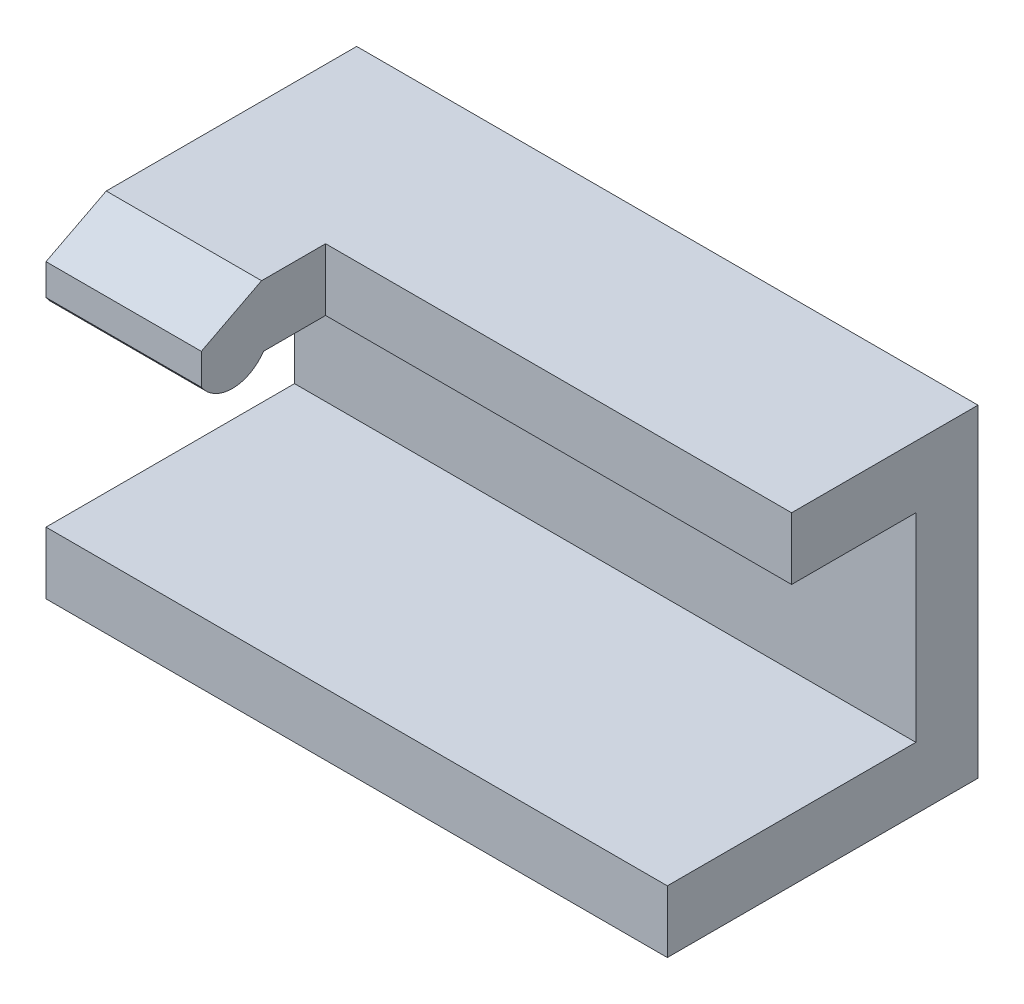
ISO-10303-21;
HEADER;
FILE_DESCRIPTION(('STEP AP214'),'2;1');
FILE_NAME('part.step','',(''),(''),'','','');
FILE_SCHEMA(('AUTOMOTIVE_DESIGN { 1 0 10303 214 1 1 1 1 }'));
ENDSEC;
DATA;
#1=APPLICATION_CONTEXT('core data for automotive mechanical design processes');
#2=APPLICATION_PROTOCOL_DEFINITION('international standard','automotive_design',2000,#1);
#3=PRODUCT_CONTEXT('',#1,'mechanical');
#4=PRODUCT('Part','Part','',(#3));
#5=PRODUCT_RELATED_PRODUCT_CATEGORY('part','',(#4));
#6=PRODUCT_DEFINITION_FORMATION('','',#4);
#7=PRODUCT_DEFINITION_CONTEXT('part definition',#1,'design');
#8=PRODUCT_DEFINITION('design','',#6,#7);
#9=PRODUCT_DEFINITION_SHAPE('','',#8);
#10=(LENGTH_UNIT() NAMED_UNIT(*) SI_UNIT(.MILLI.,.METRE.));
#11=(NAMED_UNIT(*) PLANE_ANGLE_UNIT() SI_UNIT($,.RADIAN.));
#12=(NAMED_UNIT(*) SI_UNIT($,.STERADIAN.) SOLID_ANGLE_UNIT());
#13=UNCERTAINTY_MEASURE_WITH_UNIT(LENGTH_MEASURE(1.E-05),#10,'distance_accuracy_value','');
#14=(GEOMETRIC_REPRESENTATION_CONTEXT(3) GLOBAL_UNCERTAINTY_ASSIGNED_CONTEXT((#13)) GLOBAL_UNIT_ASSIGNED_CONTEXT((#10,
#11,#12)) REPRESENTATION_CONTEXT('',''));
#15=CARTESIAN_POINT('',(0.,0.,0.));
#16=DIRECTION('',(0.,0.,1.));
#17=DIRECTION('',(1.,0.,0.));
#18=AXIS2_PLACEMENT_3D('',#15,#16,#17);
#19=CARTESIAN_POINT('',(0.,4.064,12.7));
#20=DIRECTION('',(-1.,0.,0.));
#21=DIRECTION('',(0.,-1.,0.));
#22=AXIS2_PLACEMENT_3D('',#19,#20,#21);
#23=PLANE('',#22);
#24=DIRECTION('',(0.,1.,0.));
#25=VECTOR('',#24,1.);
#26=CARTESIAN_POINT('',(0.,4.064,7.62));
#27=LINE('',#26,#25);
#28=CARTESIAN_POINT('',(0.,4.064,7.62));
#29=VERTEX_POINT('',#28);
#30=CARTESIAN_POINT('',(0.,6.604,7.62));
#31=VERTEX_POINT('',#30);
#32=EDGE_CURVE('E139',#29,#31,#27,.T.);
#33=ORIENTED_EDGE('',*,*,#32,.T.);
#34=DIRECTION('',(0.,0.,1.));
#35=VECTOR('',#34,1.);
#36=CARTESIAN_POINT('',(0.,6.604,10.2377193860486));
#37=LINE('',#36,#35);
#38=CARTESIAN_POINT('',(0.,6.604,10.2377193860486));
#39=VERTEX_POINT('',#38);
#40=EDGE_CURVE('E191',#31,#39,#37,.T.);
#41=ORIENTED_EDGE('',*,*,#40,.T.);
#42=DIRECTION('',(0.,-0.458399351245607,0.888746327574751));
#43=VECTOR('',#42,1.);
#44=CARTESIAN_POINT('',(0.,5.334,12.7));
#45=LINE('',#44,#43);
#46=CARTESIAN_POINT('',(0.,5.334,12.7));
#47=VERTEX_POINT('',#46);
#48=EDGE_CURVE('E197',#39,#47,#45,.T.);
#49=ORIENTED_EDGE('',*,*,#48,.T.);
#50=DIRECTION('',(0.,1.,0.));
#51=VECTOR('',#50,1.);
#52=CARTESIAN_POINT('',(0.,4.064,12.7));
#53=LINE('',#52,#51);
#54=CARTESIAN_POINT('',(0.,4.064,12.7));
#55=VERTEX_POINT('',#54);
#56=EDGE_CURVE('E146',#55,#47,#53,.T.);
#57=ORIENTED_EDGE('',*,*,#56,.F.);
#58=CARTESIAN_POINT('',(0.,4.90642269675027,11.43));
#59=DIRECTION('',(-1.,0.,0.));
#60=DIRECTION('',(0.,-1.,0.));
#61=AXIS2_PLACEMENT_3D('',#58,#59,#60);
#62=CIRCLE('',#61,1.524);
#63=CARTESIAN_POINT('',(0.,4.064,10.16));
#64=VERTEX_POINT('',#63);
#65=EDGE_CURVE('E76',#55,#64,#62,.F.);
#66=ORIENTED_EDGE('',*,*,#65,.T.);
#67=DIRECTION('',(0.,0.,-1.));
#68=VECTOR('',#67,1.);
#69=CARTESIAN_POINT('',(0.,4.064,12.7));
#70=LINE('',#69,#68);
#71=EDGE_CURVE('E61',#64,#29,#70,.T.);
#72=ORIENTED_EDGE('',*,*,#71,.T.);
#73=EDGE_LOOP('',(#33,#41,#49,#57,#66,#72));
#74=FACE_BOUND('',#73,.T.);
#75=ADVANCED_FACE('F38',(#74),#23,.F.);
#76=CARTESIAN_POINT('',(0.,0.,2.54));
#77=DIRECTION('',(0.,0.,1.));
#78=DIRECTION('',(1.,0.,0.));
#79=AXIS2_PLACEMENT_3D('',#76,#77,#78);
#80=PLANE('',#79);
#81=DIRECTION('',(0.,1.,0.));
#82=VECTOR('',#81,1.);
#83=CARTESIAN_POINT('',(0.,0.,2.54));
#84=LINE('',#83,#82);
#85=CARTESIAN_POINT('',(0.,2.794,2.54));
#86=VERTEX_POINT('',#85);
#87=CARTESIAN_POINT('',(0.,4.064,2.54));
#88=VERTEX_POINT('',#87);
#89=EDGE_CURVE('E52',#86,#88,#84,.T.);
#90=ORIENTED_EDGE('',*,*,#89,.F.);
#91=DIRECTION('',(-1.,0.,0.));
#92=VECTOR('',#91,1.);
#93=CARTESIAN_POINT('',(0.,2.794,2.54));
#94=LINE('',#93,#92);
#95=CARTESIAN_POINT('',(-6.35,2.794,2.54));
#96=VERTEX_POINT('',#95);
#97=EDGE_CURVE('E213',#86,#96,#94,.T.);
#98=ORIENTED_EDGE('',*,*,#97,.T.);
#99=DIRECTION('',(0.,-1.,0.));
#100=VECTOR('',#99,1.);
#101=CARTESIAN_POINT('',(-6.35,0.,2.54));
#102=LINE('',#101,#100);
#103=CARTESIAN_POINT('',(-6.35,-4.064,2.54));
#104=VERTEX_POINT('',#103);
#105=EDGE_CURVE('E124',#96,#104,#102,.T.);
#106=ORIENTED_EDGE('',*,*,#105,.T.);
#107=DIRECTION('',(1.,0.,0.));
#108=VECTOR('',#107,1.);
#109=CARTESIAN_POINT('',(0.,-4.064,2.54));
#110=LINE('',#109,#108);
#111=CARTESIAN_POINT('',(19.05,-4.064,2.54));
#112=VERTEX_POINT('',#111);
#113=EDGE_CURVE('E122',#104,#112,#110,.T.);
#114=ORIENTED_EDGE('',*,*,#113,.T.);
#115=DIRECTION('',(0.,-1.,0.));
#116=VECTOR('',#115,1.);
#117=CARTESIAN_POINT('',(19.05,0.,2.54));
#118=LINE('',#117,#116);
#119=CARTESIAN_POINT('',(19.05,4.064,2.54));
#120=VERTEX_POINT('',#119);
#121=EDGE_CURVE('E119',#120,#112,#118,.T.);
#122=ORIENTED_EDGE('',*,*,#121,.F.);
#123=DIRECTION('',(1.,0.,0.));
#124=VECTOR('',#123,1.);
#125=CARTESIAN_POINT('',(0.,4.064,2.54));
#126=LINE('',#125,#124);
#127=EDGE_CURVE('E103',#88,#120,#126,.T.);
#128=ORIENTED_EDGE('',*,*,#127,.F.);
#129=EDGE_LOOP('',(#90,#98,#106,#114,#122,#128));
#130=FACE_BOUND('',#129,.T.);
#131=ADVANCED_FACE('F120',(#130),#80,.T.);
#132=CARTESIAN_POINT('',(0.,0.,0.));
#133=DIRECTION('',(0.,0.,1.));
#134=DIRECTION('',(1.,0.,0.));
#135=AXIS2_PLACEMENT_3D('',#132,#133,#134);
#136=PLANE('',#135);
#137=DIRECTION('',(1.,0.,0.));
#138=VECTOR('',#137,1.);
#139=CARTESIAN_POINT('',(-19.8523126484497,6.60400000000001,0.));
#140=LINE('',#139,#138);
#141=CARTESIAN_POINT('',(-6.35,6.60400000000001,0.));
#142=VERTEX_POINT('',#141);
#143=CARTESIAN_POINT('',(19.05,6.60399999999999,0.));
#144=VERTEX_POINT('',#143);
#145=EDGE_CURVE('E187',#142,#144,#140,.T.);
#146=ORIENTED_EDGE('',*,*,#145,.T.);
#147=DIRECTION('',(0.,-1.,0.));
#148=VECTOR('',#147,1.);
#149=CARTESIAN_POINT('',(19.05,0.,0.));
#150=LINE('',#149,#148);
#151=CARTESIAN_POINT('',(19.05,-6.604,0.));
#152=VERTEX_POINT('',#151);
#153=EDGE_CURVE('E134',#144,#152,#150,.T.);
#154=ORIENTED_EDGE('',*,*,#153,.T.);
#155=DIRECTION('',(1.,0.,0.));
#156=VECTOR('',#155,1.);
#157=CARTESIAN_POINT('',(-19.113342038932,-6.60400000000005,0.));
#158=LINE('',#157,#156);
#159=CARTESIAN_POINT('',(-6.35,-6.60400000000004,0.));
#160=VERTEX_POINT('',#159);
#161=EDGE_CURVE('E224',#160,#152,#158,.T.);
#162=ORIENTED_EDGE('',*,*,#161,.F.);
#163=DIRECTION('',(0.,-1.,0.));
#164=VECTOR('',#163,1.);
#165=CARTESIAN_POINT('',(-6.35,0.,0.));
#166=LINE('',#165,#164);
#167=CARTESIAN_POINT('',(-6.35,2.794,0.));
#168=VERTEX_POINT('',#167);
#169=EDGE_CURVE('E159',#168,#160,#166,.T.);
#170=ORIENTED_EDGE('',*,*,#169,.F.);
#171=DIRECTION('',(-1.,0.,0.));
#172=VECTOR('',#171,1.);
#173=CARTESIAN_POINT('',(0.,2.794,0.));
#174=LINE('',#173,#172);
#175=CARTESIAN_POINT('',(0.,2.794,0.));
#176=VERTEX_POINT('',#175);
#177=EDGE_CURVE('E200',#176,#168,#174,.T.);
#178=ORIENTED_EDGE('',*,*,#177,.F.);
#179=DIRECTION('',(0.,1.,0.));
#180=VECTOR('',#179,1.);
#181=CARTESIAN_POINT('',(0.,0.,0.));
#182=LINE('',#181,#180);
#183=CARTESIAN_POINT('',(0.,4.064,0.));
#184=VERTEX_POINT('',#183);
#185=EDGE_CURVE('E13',#176,#184,#182,.T.);
#186=ORIENTED_EDGE('',*,*,#185,.T.);
#187=DIRECTION('',(-1.,0.,0.));
#188=VECTOR('',#187,1.);
#189=CARTESIAN_POINT('',(0.,4.064,0.));
#190=LINE('',#189,#188);
#191=CARTESIAN_POINT('',(-6.35,4.064,0.));
#192=VERTEX_POINT('',#191);
#193=EDGE_CURVE('E206',#184,#192,#190,.T.);
#194=ORIENTED_EDGE('',*,*,#193,.T.);
#195=EDGE_CURVE('E125',#142,#192,#166,.T.);
#196=ORIENTED_EDGE('',*,*,#195,.F.);
#197=EDGE_LOOP('',(#146,#154,#162,#170,#178,#186,#194,#196));
#198=FACE_BOUND('',#197,.T.);
#199=ADVANCED_FACE('F289',(#198),#136,.F.);
#200=CARTESIAN_POINT('',(-6.35,0.,2.54));
#201=DIRECTION('',(1.,0.,0.));
#202=DIRECTION('',(0.,0.,-1.));
#203=AXIS2_PLACEMENT_3D('',#200,#201,#202);
#204=PLANE('',#203);
#205=DIRECTION('',(0.,0.,1.));
#206=VECTOR('',#205,1.);
#207=CARTESIAN_POINT('',(-6.35,2.794,2.54));
#208=LINE('',#207,#206);
#209=EDGE_CURVE('E45',#168,#96,#208,.T.);
#210=ORIENTED_EDGE('',*,*,#209,.F.);
#211=ORIENTED_EDGE('',*,*,#169,.T.);
#212=DIRECTION('',(0.,0.,1.));
#213=VECTOR('',#212,1.);
#214=CARTESIAN_POINT('',(-6.35,-6.60400000000004,12.700000000109));
#215=LINE('',#214,#213);
#216=CARTESIAN_POINT('',(-6.35,-6.60400000000004,12.700000000109));
#217=VERTEX_POINT('',#216);
#218=EDGE_CURVE('E220',#160,#217,#215,.T.);
#219=ORIENTED_EDGE('',*,*,#218,.T.);
#220=DIRECTION('',(0.,1.,0.));
#221=VECTOR('',#220,1.);
#222=CARTESIAN_POINT('',(-6.35,0.,12.6999999999953));
#223=LINE('',#222,#221);
#224=CARTESIAN_POINT('',(-6.35,-4.064,12.700000000109));
#225=VERTEX_POINT('',#224);
#226=EDGE_CURVE('E166',#217,#225,#223,.T.);
#227=ORIENTED_EDGE('',*,*,#226,.T.);
#228=DIRECTION('',(0.,0.,-1.));
#229=VECTOR('',#228,1.);
#230=CARTESIAN_POINT('',(-6.35,-4.064,7.62));
#231=LINE('',#230,#229);
#232=EDGE_CURVE('E115',#225,#104,#231,.T.);
#233=ORIENTED_EDGE('',*,*,#232,.T.);
#234=ORIENTED_EDGE('',*,*,#105,.F.);
#235=EDGE_LOOP('',(#210,#211,#219,#227,#233,#234));
#236=FACE_BOUND('',#235,.T.);
#237=ADVANCED_FACE('F300',(#236),#204,.F.);
#238=CARTESIAN_POINT('',(0.,0.,7.62));
#239=DIRECTION('',(0.,0.,1.));
#240=DIRECTION('',(1.,0.,0.));
#241=AXIS2_PLACEMENT_3D('',#238,#239,#240);
#242=PLANE('',#241);
#243=DIRECTION('',(0.,1.,0.));
#244=VECTOR('',#243,1.);
#245=CARTESIAN_POINT('',(19.05,0.,7.62));
#246=LINE('',#245,#244);
#247=CARTESIAN_POINT('',(19.05,4.064,7.62));
#248=VERTEX_POINT('',#247);
#249=CARTESIAN_POINT('',(19.05,6.60399999999999,7.62));
#250=VERTEX_POINT('',#249);
#251=EDGE_CURVE('E131',#248,#250,#246,.T.);
#252=ORIENTED_EDGE('',*,*,#251,.T.);
#253=DIRECTION('',(-1.,0.,0.));
#254=VECTOR('',#253,1.);
#255=CARTESIAN_POINT('',(26.7751084134787,6.60399999999999,7.62));
#256=LINE('',#255,#254);
#257=EDGE_CURVE('E217',#250,#31,#256,.T.);
#258=ORIENTED_EDGE('',*,*,#257,.T.);
#259=ORIENTED_EDGE('',*,*,#32,.F.);
#260=DIRECTION('',(1.,0.,0.));
#261=VECTOR('',#260,1.);
#262=CARTESIAN_POINT('',(0.,4.064,7.62));
#263=LINE('',#262,#261);
#264=EDGE_CURVE('E114',#29,#248,#263,.T.);
#265=ORIENTED_EDGE('',*,*,#264,.T.);
#266=EDGE_LOOP('',(#252,#258,#259,#265));
#267=FACE_BOUND('',#266,.T.);
#268=ADVANCED_FACE('F325',(#267),#242,.T.);
#269=CARTESIAN_POINT('',(19.05,0.,2.54));
#270=DIRECTION('',(1.,0.,0.));
#271=DIRECTION('',(0.,1.,0.));
#272=AXIS2_PLACEMENT_3D('',#269,#270,#271);
#273=PLANE('',#272);
#274=ORIENTED_EDGE('',*,*,#153,.F.);
#275=DIRECTION('',(0.,0.,1.));
#276=VECTOR('',#275,1.);
#277=CARTESIAN_POINT('',(19.05,6.60399999999999,7.62));
#278=LINE('',#277,#276);
#279=EDGE_CURVE('E216',#144,#250,#278,.T.);
#280=ORIENTED_EDGE('',*,*,#279,.T.);
#281=ORIENTED_EDGE('',*,*,#251,.F.);
#282=DIRECTION('',(0.,0.,-1.));
#283=VECTOR('',#282,1.);
#284=CARTESIAN_POINT('',(19.05,4.064,7.62));
#285=LINE('',#284,#283);
#286=EDGE_CURVE('E109',#248,#120,#285,.T.);
#287=ORIENTED_EDGE('',*,*,#286,.T.);
#288=ORIENTED_EDGE('',*,*,#121,.T.);
#289=DIRECTION('',(0.,0.,-1.));
#290=VECTOR('',#289,1.);
#291=CARTESIAN_POINT('',(19.05,-4.064,7.62));
#292=LINE('',#291,#290);
#293=CARTESIAN_POINT('',(19.05,-4.064,12.700000000109));
#294=VERTEX_POINT('',#293);
#295=EDGE_CURVE('E167',#294,#112,#292,.T.);
#296=ORIENTED_EDGE('',*,*,#295,.F.);
#297=DIRECTION('',(0.,-1.,0.));
#298=VECTOR('',#297,1.);
#299=CARTESIAN_POINT('',(19.05,0.,12.6999999999953));
#300=LINE('',#299,#298);
#301=CARTESIAN_POINT('',(19.05,-6.604,12.700000000109));
#302=VERTEX_POINT('',#301);
#303=EDGE_CURVE('E164',#294,#302,#300,.T.);
#304=ORIENTED_EDGE('',*,*,#303,.T.);
#305=DIRECTION('',(0.,0.,-1.));
#306=VECTOR('',#305,1.);
#307=CARTESIAN_POINT('',(19.05,-6.604,12.700000000109));
#308=LINE('',#307,#306);
#309=EDGE_CURVE('E228',#302,#152,#308,.T.);
#310=ORIENTED_EDGE('',*,*,#309,.T.);
#311=EDGE_LOOP('',(#274,#280,#281,#287,#288,#296,#304,#310));
#312=FACE_BOUND('',#311,.T.);
#313=ADVANCED_FACE('F128',(#312),#273,.T.);
#314=ORIENTED_EDGE('',*,*,#195,.T.);
#315=DIRECTION('',(0.,0.,-1.));
#316=VECTOR('',#315,1.);
#317=CARTESIAN_POINT('',(-6.35,4.064,7.62));
#318=LINE('',#317,#316);
#319=CARTESIAN_POINT('',(-6.35,4.064,10.16));
#320=VERTEX_POINT('',#319);
#321=EDGE_CURVE('E132',#320,#192,#318,.T.);
#322=ORIENTED_EDGE('',*,*,#321,.F.);
#323=CARTESIAN_POINT('',(-6.35,4.90642269675027,11.43));
#324=DIRECTION('',(-1.,0.,0.));
#325=DIRECTION('',(0.,0.,-1.));
#326=AXIS2_PLACEMENT_3D('',#323,#324,#325);
#327=CIRCLE('',#326,1.524);
#328=CARTESIAN_POINT('',(-6.35,4.064,12.7));
#329=VERTEX_POINT('',#328);
#330=EDGE_CURVE('E179',#320,#329,#327,.T.);
#331=ORIENTED_EDGE('',*,*,#330,.T.);
#332=DIRECTION('',(0.,-1.,0.));
#333=VECTOR('',#332,1.);
#334=CARTESIAN_POINT('',(-6.35,4.064,12.7));
#335=LINE('',#334,#333);
#336=CARTESIAN_POINT('',(-6.35,5.334,12.7));
#337=VERTEX_POINT('',#336);
#338=EDGE_CURVE('E141',#337,#329,#335,.T.);
#339=ORIENTED_EDGE('',*,*,#338,.F.);
#340=DIRECTION('',(0.,0.458399351245606,-0.888746327574751));
#341=VECTOR('',#340,1.);
#342=CARTESIAN_POINT('',(-6.35,5.334,12.7));
#343=LINE('',#342,#341);
#344=CARTESIAN_POINT('',(-6.35,6.604,10.2377193860486));
#345=VERTEX_POINT('',#344);
#346=EDGE_CURVE('E85',#337,#345,#343,.T.);
#347=ORIENTED_EDGE('',*,*,#346,.T.);
#348=DIRECTION('',(0.,0.,-1.));
#349=VECTOR('',#348,1.);
#350=CARTESIAN_POINT('',(-6.35,6.604,10.2377193860486));
#351=LINE('',#350,#349);
#352=EDGE_CURVE('E194',#345,#142,#351,.T.);
#353=ORIENTED_EDGE('',*,*,#352,.T.);
#354=EDGE_LOOP('',(#314,#322,#331,#339,#347,#353));
#355=FACE_BOUND('',#354,.T.);
#356=ADVANCED_FACE('F285',(#355),#204,.F.);
#357=CARTESIAN_POINT('',(0.,4.064,7.62));
#358=DIRECTION('',(0.,1.,0.));
#359=DIRECTION('',(0.,0.,1.));
#360=AXIS2_PLACEMENT_3D('',#357,#358,#359);
#361=PLANE('',#360);
#362=ORIENTED_EDGE('',*,*,#321,.T.);
#363=ORIENTED_EDGE('',*,*,#193,.F.);
#364=DIRECTION('',(0.,0.,1.));
#365=VECTOR('',#364,1.);
#366=CARTESIAN_POINT('',(0.,4.064,-3.556));
#367=LINE('',#366,#365);
#368=EDGE_CURVE('E112',#184,#88,#367,.T.);
#369=ORIENTED_EDGE('',*,*,#368,.T.);
#370=ORIENTED_EDGE('',*,*,#127,.T.);
#371=ORIENTED_EDGE('',*,*,#286,.F.);
#372=ORIENTED_EDGE('',*,*,#264,.F.);
#373=ORIENTED_EDGE('',*,*,#71,.F.);
#374=DIRECTION('',(-1.,0.,0.));
#375=VECTOR('',#374,1.);
#376=CARTESIAN_POINT('',(0.0898569581452811,4.064,10.16));
#377=LINE('',#376,#375);
#378=EDGE_CURVE('E145',#64,#320,#377,.T.);
#379=ORIENTED_EDGE('',*,*,#378,.T.);
#380=EDGE_LOOP('',(#362,#363,#369,#370,#371,#372,#373,#379));
#381=FACE_BOUND('',#380,.T.);
#382=ADVANCED_FACE('F106',(#381),#361,.F.);
#383=CARTESIAN_POINT('',(0.,-4.064,7.62));
#384=DIRECTION('',(0.,1.,0.));
#385=DIRECTION('',(0.,0.,1.));
#386=AXIS2_PLACEMENT_3D('',#383,#384,#385);
#387=PLANE('',#386);
#388=ORIENTED_EDGE('',*,*,#113,.F.);
#389=ORIENTED_EDGE('',*,*,#232,.F.);
#390=DIRECTION('',(-1.,0.,0.));
#391=VECTOR('',#390,1.);
#392=CARTESIAN_POINT('',(0.,-4.064,12.6999999999953));
#393=LINE('',#392,#391);
#394=EDGE_CURVE('E182',#294,#225,#393,.T.);
#395=ORIENTED_EDGE('',*,*,#394,.F.);
#396=ORIENTED_EDGE('',*,*,#295,.T.);
#397=EDGE_LOOP('',(#388,#389,#395,#396));
#398=FACE_BOUND('',#397,.T.);
#399=ADVANCED_FACE('F302',(#398),#387,.T.);
#400=CARTESIAN_POINT('',(0.,0.,12.7));
#401=DIRECTION('',(0.,0.,-1.));
#402=DIRECTION('',(-1.,0.,0.));
#403=AXIS2_PLACEMENT_3D('',#400,#401,#402);
#404=PLANE('',#403);
#405=ORIENTED_EDGE('',*,*,#338,.T.);
#406=DIRECTION('',(1.,0.,0.));
#407=VECTOR('',#406,1.);
#408=CARTESIAN_POINT('',(-6.35,4.064,12.7));
#409=LINE('',#408,#407);
#410=EDGE_CURVE('E148',#329,#55,#409,.T.);
#411=ORIENTED_EDGE('',*,*,#410,.T.);
#412=ORIENTED_EDGE('',*,*,#56,.T.);
#413=DIRECTION('',(-1.,0.,0.));
#414=VECTOR('',#413,1.);
#415=CARTESIAN_POINT('',(-6.35,5.334,12.7));
#416=LINE('',#415,#414);
#417=EDGE_CURVE('E143',#47,#337,#416,.T.);
#418=ORIENTED_EDGE('',*,*,#417,.T.);
#419=EDGE_LOOP('',(#405,#411,#412,#418));
#420=FACE_BOUND('',#419,.T.);
#421=ADVANCED_FACE('F304',(#420),#404,.F.);
#422=CARTESIAN_POINT('',(0.0898569581452811,4.90642269675027,11.43));
#423=DIRECTION('',(-1.,0.,0.));
#424=DIRECTION('',(0.,0.,1.));
#425=AXIS2_PLACEMENT_3D('',#422,#423,#424);
#426=CYLINDRICAL_SURFACE('',#425,1.524);
#427=ORIENTED_EDGE('',*,*,#65,.F.);
#428=ORIENTED_EDGE('',*,*,#410,.F.);
#429=ORIENTED_EDGE('',*,*,#330,.F.);
#430=ORIENTED_EDGE('',*,*,#378,.F.);
#431=EDGE_LOOP('',(#427,#428,#429,#430));
#432=FACE_BOUND('',#431,.T.);
#433=ADVANCED_FACE('F281',(#432),#426,.T.);
#434=CARTESIAN_POINT('',(0.,0.,12.7));
#435=DIRECTION('',(0.,0.,-1.));
#436=DIRECTION('',(-1.,0.,0.));
#437=AXIS2_PLACEMENT_3D('',#434,#435,#436);
#438=PLANE('',#437);
#439=ORIENTED_EDGE('',*,*,#394,.T.);
#440=ORIENTED_EDGE('',*,*,#226,.F.);
#441=DIRECTION('',(1.,0.,0.));
#442=VECTOR('',#441,1.);
#443=CARTESIAN_POINT('',(-19.113342038932,-6.60400000000005,12.700000000109));
#444=LINE('',#443,#442);
#445=EDGE_CURVE('E225',#217,#302,#444,.T.);
#446=ORIENTED_EDGE('',*,*,#445,.T.);
#447=ORIENTED_EDGE('',*,*,#303,.F.);
#448=EDGE_LOOP('',(#439,#440,#446,#447));
#449=FACE_BOUND('',#448,.T.);
#450=ADVANCED_FACE('F409',(#449),#438,.F.);
#451=CARTESIAN_POINT('',(-19.8523126484497,5.33400000000001,12.7));
#452=DIRECTION('',(0.,0.888746327574751,0.458399351245606));
#453=DIRECTION('',(0.,-0.458399351245606,0.888746327574751));
#454=AXIS2_PLACEMENT_3D('',#451,#452,#453);
#455=PLANE('',#454);
#456=ORIENTED_EDGE('',*,*,#346,.F.);
#457=ORIENTED_EDGE('',*,*,#417,.F.);
#458=ORIENTED_EDGE('',*,*,#48,.F.);
#459=DIRECTION('',(1.,0.,0.));
#460=VECTOR('',#459,1.);
#461=CARTESIAN_POINT('',(-19.8523126484497,6.60400000000001,10.2377193860486));
#462=LINE('',#461,#460);
#463=EDGE_CURVE('E190',#345,#39,#462,.T.);
#464=ORIENTED_EDGE('',*,*,#463,.F.);
#465=EDGE_LOOP('',(#456,#457,#458,#464));
#466=FACE_BOUND('',#465,.T.);
#467=ADVANCED_FACE('F384',(#466),#455,.T.);
#468=CARTESIAN_POINT('',(-19.8523126484497,6.60400000000001,10.2377193860486));
#469=DIRECTION('',(0.,1.,0.));
#470=DIRECTION('',(-1.,0.,0.));
#471=AXIS2_PLACEMENT_3D('',#468,#469,#470);
#472=PLANE('',#471);
#473=ORIENTED_EDGE('',*,*,#352,.F.);
#474=ORIENTED_EDGE('',*,*,#463,.T.);
#475=ORIENTED_EDGE('',*,*,#40,.F.);
#476=ORIENTED_EDGE('',*,*,#257,.F.);
#477=ORIENTED_EDGE('',*,*,#279,.F.);
#478=ORIENTED_EDGE('',*,*,#145,.F.);
#479=EDGE_LOOP('',(#473,#474,#475,#476,#477,#478));
#480=FACE_BOUND('',#479,.T.);
#481=ADVANCED_FACE('F323',(#480),#472,.T.);
#482=CARTESIAN_POINT('',(0.,0.,-3.556));
#483=DIRECTION('',(1.,0.,0.));
#484=DIRECTION('',(0.,1.,0.));
#485=AXIS2_PLACEMENT_3D('',#482,#483,#484);
#486=PLANE('',#485);
#487=DIRECTION('',(0.,0.,1.));
#488=VECTOR('',#487,1.);
#489=CARTESIAN_POINT('',(0.,2.794,-3.556));
#490=LINE('',#489,#488);
#491=EDGE_CURVE('E209',#176,#86,#490,.T.);
#492=ORIENTED_EDGE('',*,*,#491,.T.);
#493=ORIENTED_EDGE('',*,*,#89,.T.);
#494=ORIENTED_EDGE('',*,*,#368,.F.);
#495=ORIENTED_EDGE('',*,*,#185,.F.);
#496=EDGE_LOOP('',(#492,#493,#494,#495));
#497=FACE_BOUND('',#496,.T.);
#498=ADVANCED_FACE('F292',(#497),#486,.F.);
#499=CARTESIAN_POINT('',(0.,2.794,-3.556));
#500=DIRECTION('',(0.,1.,0.));
#501=DIRECTION('',(0.,0.,1.));
#502=AXIS2_PLACEMENT_3D('',#499,#500,#501);
#503=PLANE('',#502);
#504=ORIENTED_EDGE('',*,*,#177,.T.);
#505=ORIENTED_EDGE('',*,*,#209,.T.);
#506=ORIENTED_EDGE('',*,*,#97,.F.);
#507=ORIENTED_EDGE('',*,*,#491,.F.);
#508=EDGE_LOOP('',(#504,#505,#506,#507));
#509=FACE_BOUND('',#508,.T.);
#510=ADVANCED_FACE('F296',(#509),#503,.T.);
#511=CARTESIAN_POINT('',(-19.113342038932,-6.60400000000005,12.700000000109));
#512=DIRECTION('',(0.,-1.,0.));
#513=DIRECTION('',(1.,0.,0.));
#514=AXIS2_PLACEMENT_3D('',#511,#512,#513);
#515=PLANE('',#514);
#516=ORIENTED_EDGE('',*,*,#218,.F.);
#517=ORIENTED_EDGE('',*,*,#161,.T.);
#518=ORIENTED_EDGE('',*,*,#309,.F.);
#519=ORIENTED_EDGE('',*,*,#445,.F.);
#520=EDGE_LOOP('',(#516,#517,#518,#519));
#521=FACE_BOUND('',#520,.T.);
#522=ADVANCED_FACE('F242',(#521),#515,.T.);
#523=CLOSED_SHELL('',(#75,#131,#199,#237,#268,#313,#356,#382,#399,#421,#433,#450,#467,#481,#498,
#510,#522));
#524=MANIFOLD_SOLID_BREP('B2',#523);
#525=ADVANCED_BREP_SHAPE_REPRESENTATION('',(#18,#524),#14);
#526=SHAPE_DEFINITION_REPRESENTATION(#9,#525);
ENDSEC;
END-ISO-10303-21;
